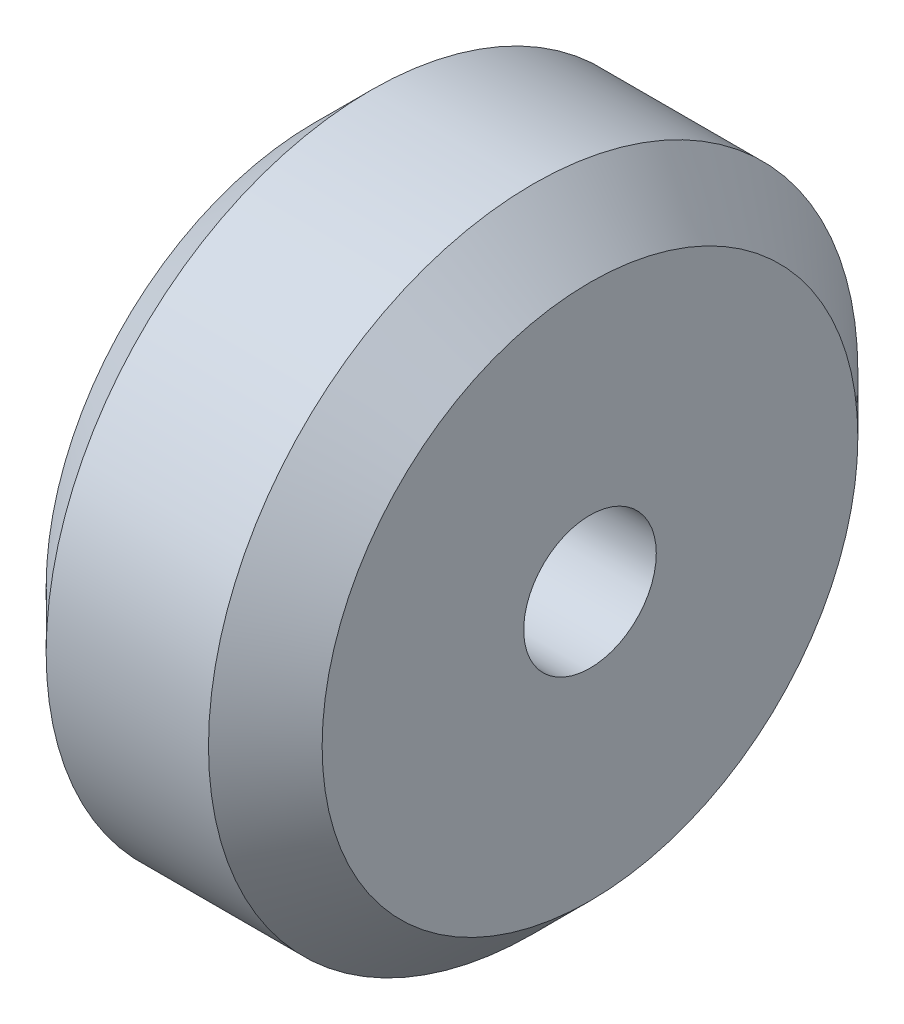
ISO-10303-21;
HEADER;
FILE_DESCRIPTION(('STEP AP214'),'2;1');
FILE_NAME('part.step','',(''),(''),'','','');
FILE_SCHEMA(('AUTOMOTIVE_DESIGN { 1 0 10303 214 1 1 1 1 }'));
ENDSEC;
DATA;
#1=APPLICATION_CONTEXT('core data for automotive mechanical design processes');
#2=APPLICATION_PROTOCOL_DEFINITION('international standard','automotive_design',2000,#1);
#3=PRODUCT_CONTEXT('',#1,'mechanical');
#4=PRODUCT('Part','Part','',(#3));
#5=PRODUCT_RELATED_PRODUCT_CATEGORY('part','',(#4));
#6=PRODUCT_DEFINITION_FORMATION('','',#4);
#7=PRODUCT_DEFINITION_CONTEXT('part definition',#1,'design');
#8=PRODUCT_DEFINITION('design','',#6,#7);
#9=PRODUCT_DEFINITION_SHAPE('','',#8);
#10=(LENGTH_UNIT() NAMED_UNIT(*) SI_UNIT(.MILLI.,.METRE.));
#11=(NAMED_UNIT(*) PLANE_ANGLE_UNIT() SI_UNIT($,.RADIAN.));
#12=(NAMED_UNIT(*) SI_UNIT($,.STERADIAN.) SOLID_ANGLE_UNIT());
#13=UNCERTAINTY_MEASURE_WITH_UNIT(LENGTH_MEASURE(1.E-05),#10,'distance_accuracy_value','');
#14=(GEOMETRIC_REPRESENTATION_CONTEXT(3) GLOBAL_UNCERTAINTY_ASSIGNED_CONTEXT((#13)) GLOBAL_UNIT_ASSIGNED_CONTEXT((#10,
#11,#12)) REPRESENTATION_CONTEXT('',''));
#15=CARTESIAN_POINT('',(0.,0.,0.));
#16=DIRECTION('',(0.,0.,1.));
#17=DIRECTION('',(1.,0.,0.));
#18=AXIS2_PLACEMENT_3D('',#15,#16,#17);
#19=CARTESIAN_POINT('',(74.2934699743332,77.0421456383068,0.));
#20=DIRECTION('',(-1.,0.,0.));
#21=DIRECTION('',(0.,0.,1.));
#22=AXIS2_PLACEMENT_3D('',#19,#20,#21);
#23=CONICAL_SURFACE('',#22,12.,0.785398163397455);
#24=CARTESIAN_POINT('',(76.3934699743332,77.0421456383068,0.));
#25=DIRECTION('',(1.,0.,0.));
#26=DIRECTION('',(0.,0.,-1.));
#27=AXIS2_PLACEMENT_3D('',#24,#25,#26);
#28=CIRCLE('',#27,9.89999999999998);
#29=CARTESIAN_POINT('',(76.3934699743332,77.0421456383068,-9.89999999999998));
#30=VERTEX_POINT('',#29);
#31=EDGE_CURVE('E61',#30,#30,#28,.T.);
#32=ORIENTED_EDGE('',*,*,#31,.F.);
#33=EDGE_LOOP('',(#32));
#34=FACE_BOUND('',#33,.T.);
#35=CARTESIAN_POINT('',(74.2934699743332,77.0421456383068,0.));
#36=DIRECTION('',(1.,0.,0.));
#37=DIRECTION('',(0.,0.,-1.));
#38=AXIS2_PLACEMENT_3D('',#35,#36,#37);
#39=CIRCLE('',#38,12.);
#40=CARTESIAN_POINT('',(74.2934699743332,77.0421456383068,-12.));
#41=VERTEX_POINT('',#40);
#42=EDGE_CURVE('E10',#41,#41,#39,.T.);
#43=ORIENTED_EDGE('',*,*,#42,.T.);
#44=EDGE_LOOP('',(#43));
#45=FACE_BOUND('',#44,.T.);
#46=ADVANCED_FACE('F39',(#34,#45),#23,.T.);
#47=CARTESIAN_POINT('',(71.2934699743332,77.0421456383068,0.));
#48=DIRECTION('',(1.,0.,0.));
#49=DIRECTION('',(0.,0.,-1.));
#50=AXIS2_PLACEMENT_3D('',#47,#48,#49);
#51=CYLINDRICAL_SURFACE('',#50,12.);
#52=ORIENTED_EDGE('',*,*,#42,.F.);
#53=EDGE_LOOP('',(#52));
#54=FACE_BOUND('',#53,.T.);
#55=CARTESIAN_POINT('',(68.2934699743332,77.0421456383068,0.));
#56=DIRECTION('',(1.,0.,0.));
#57=DIRECTION('',(0.,0.,-1.));
#58=AXIS2_PLACEMENT_3D('',#55,#56,#57);
#59=CIRCLE('',#58,12.);
#60=CARTESIAN_POINT('',(68.2934699743332,77.0421456383068,-12.));
#61=VERTEX_POINT('',#60);
#62=EDGE_CURVE('E45',#61,#61,#59,.T.);
#63=ORIENTED_EDGE('',*,*,#62,.T.);
#64=EDGE_LOOP('',(#63));
#65=FACE_BOUND('',#64,.T.);
#66=ADVANCED_FACE('F69',(#54,#65),#51,.T.);
#67=CARTESIAN_POINT('',(68.2934699743332,77.0421456383068,0.));
#68=DIRECTION('',(1.,0.,0.));
#69=DIRECTION('',(0.,0.,-1.));
#70=AXIS2_PLACEMENT_3D('',#67,#68,#69);
#71=CONICAL_SURFACE('',#70,12.,0.785398163397455);
#72=CARTESIAN_POINT('',(66.1934699743332,77.0421456383068,0.));
#73=DIRECTION('',(1.,0.,0.));
#74=DIRECTION('',(0.,0.,-1.));
#75=AXIS2_PLACEMENT_3D('',#72,#73,#74);
#76=CIRCLE('',#75,9.89999999999998);
#77=CARTESIAN_POINT('',(66.1934699743332,77.0421456383068,-9.89999999999998));
#78=VERTEX_POINT('',#77);
#79=EDGE_CURVE('E49',#78,#78,#76,.T.);
#80=ORIENTED_EDGE('',*,*,#79,.T.);
#81=EDGE_LOOP('',(#80));
#82=FACE_BOUND('',#81,.T.);
#83=ORIENTED_EDGE('',*,*,#62,.F.);
#84=EDGE_LOOP('',(#83));
#85=FACE_BOUND('',#84,.T.);
#86=ADVANCED_FACE('F73',(#82,#85),#71,.T.);
#87=CARTESIAN_POINT('',(66.1934699743332,0.,0.));
#88=DIRECTION('',(1.,0.,0.));
#89=DIRECTION('',(0.,0.,-1.));
#90=AXIS2_PLACEMENT_3D('',#87,#88,#89);
#91=PLANE('',#90);
#92=ORIENTED_EDGE('',*,*,#79,.F.);
#93=EDGE_LOOP('',(#92));
#94=FACE_BOUND('',#93,.T.);
#95=CARTESIAN_POINT('',(66.1934699743332,77.0421456383068,0.));
#96=DIRECTION('',(1.,0.,0.));
#97=DIRECTION('',(0.,0.,-1.));
#98=AXIS2_PLACEMENT_3D('',#95,#96,#97);
#99=CIRCLE('',#98,2.44999999999999);
#100=CARTESIAN_POINT('',(66.1934699743332,77.0421456383068,-2.44999999999999));
#101=VERTEX_POINT('',#100);
#102=EDGE_CURVE('E53',#101,#101,#99,.T.);
#103=ORIENTED_EDGE('',*,*,#102,.T.);
#104=EDGE_LOOP('',(#103));
#105=FACE_BOUND('',#104,.T.);
#106=ADVANCED_FACE('F78',(#94,#105),#91,.F.);
#107=CARTESIAN_POINT('',(71.2934699743332,77.0421456383068,0.));
#108=DIRECTION('',(1.,0.,0.));
#109=DIRECTION('',(0.,0.,-1.));
#110=AXIS2_PLACEMENT_3D('',#107,#108,#109);
#111=CYLINDRICAL_SURFACE('',#110,2.44999999999999);
#112=ORIENTED_EDGE('',*,*,#102,.F.);
#113=EDGE_LOOP('',(#112));
#114=FACE_BOUND('',#113,.T.);
#115=CARTESIAN_POINT('',(76.3934699743332,77.0421456383068,0.));
#116=DIRECTION('',(1.,0.,0.));
#117=DIRECTION('',(0.,0.,-1.));
#118=AXIS2_PLACEMENT_3D('',#115,#116,#117);
#119=CIRCLE('',#118,2.44999999999999);
#120=CARTESIAN_POINT('',(76.3934699743332,77.0421456383068,-2.44999999999999));
#121=VERTEX_POINT('',#120);
#122=EDGE_CURVE('E58',#121,#121,#119,.T.);
#123=ORIENTED_EDGE('',*,*,#122,.T.);
#124=EDGE_LOOP('',(#123));
#125=FACE_BOUND('',#124,.T.);
#126=ADVANCED_FACE('F84',(#114,#125),#111,.F.);
#127=CARTESIAN_POINT('',(76.3934699743332,-1.07088117798631E-13,0.));
#128=DIRECTION('',(1.,0.,0.));
#129=DIRECTION('',(0.,0.,-1.));
#130=AXIS2_PLACEMENT_3D('',#127,#128,#129);
#131=PLANE('',#130);
#132=ORIENTED_EDGE('',*,*,#31,.T.);
#133=EDGE_LOOP('',(#132));
#134=FACE_BOUND('',#133,.T.);
#135=ORIENTED_EDGE('',*,*,#122,.F.);
#136=EDGE_LOOP('',(#135));
#137=FACE_BOUND('',#136,.T.);
#138=ADVANCED_FACE('F65',(#134,#137),#131,.T.);
#139=CLOSED_SHELL('',(#46,#66,#86,#106,#126,#138));
#140=MANIFOLD_SOLID_BREP('B2',#139);
#141=ADVANCED_BREP_SHAPE_REPRESENTATION('',(#18,#140),#14);
#142=SHAPE_DEFINITION_REPRESENTATION(#9,#141);
ENDSEC;
END-ISO-10303-21;
